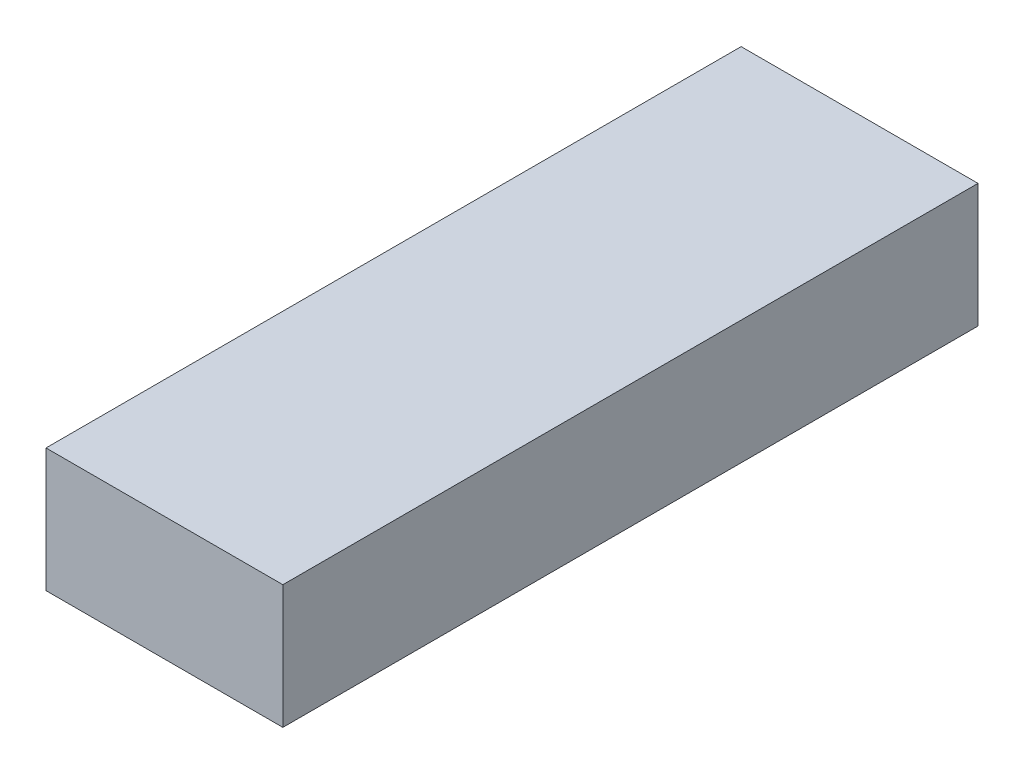
ISO-10303-21;
HEADER;
FILE_DESCRIPTION(('STEP AP214'),'2;1');
FILE_NAME('part.step','',(''),(''),'','','');
FILE_SCHEMA(('AUTOMOTIVE_DESIGN { 1 0 10303 214 1 1 1 1 }'));
ENDSEC;
DATA;
#1=APPLICATION_CONTEXT('core data for automotive mechanical design processes');
#2=APPLICATION_PROTOCOL_DEFINITION('international standard','automotive_design',2000,#1);
#3=PRODUCT_CONTEXT('',#1,'mechanical');
#4=PRODUCT('Part','Part','',(#3));
#5=PRODUCT_RELATED_PRODUCT_CATEGORY('part','',(#4));
#6=PRODUCT_DEFINITION_FORMATION('','',#4);
#7=PRODUCT_DEFINITION_CONTEXT('part definition',#1,'design');
#8=PRODUCT_DEFINITION('design','',#6,#7);
#9=PRODUCT_DEFINITION_SHAPE('','',#8);
#10=(LENGTH_UNIT() NAMED_UNIT(*) SI_UNIT(.MILLI.,.METRE.));
#11=(NAMED_UNIT(*) PLANE_ANGLE_UNIT() SI_UNIT($,.RADIAN.));
#12=(NAMED_UNIT(*) SI_UNIT($,.STERADIAN.) SOLID_ANGLE_UNIT());
#13=UNCERTAINTY_MEASURE_WITH_UNIT(LENGTH_MEASURE(1.E-05),#10,'distance_accuracy_value','');
#14=(GEOMETRIC_REPRESENTATION_CONTEXT(3) GLOBAL_UNCERTAINTY_ASSIGNED_CONTEXT((#13)) GLOBAL_UNIT_ASSIGNED_CONTEXT((#10,
#11,#12)) REPRESENTATION_CONTEXT('',''));
#15=CARTESIAN_POINT('',(0.,0.,0.));
#16=DIRECTION('',(0.,0.,1.));
#17=DIRECTION('',(1.,0.,0.));
#18=AXIS2_PLACEMENT_3D('',#15,#16,#17);
#19=CARTESIAN_POINT('',(0.,24.,0.));
#20=DIRECTION('',(0.,0.,-1.));
#21=DIRECTION('',(-1.,0.,0.));
#22=AXIS2_PLACEMENT_3D('',#19,#20,#21);
#23=PLANE('',#22);
#24=DIRECTION('',(1.,0.,0.));
#25=VECTOR('',#24,1.);
#26=CARTESIAN_POINT('',(0.,0.,0.));
#27=LINE('',#26,#25);
#28=CARTESIAN_POINT('',(0.,0.,0.));
#29=VERTEX_POINT('',#28);
#30=CARTESIAN_POINT('',(46.,0.,0.));
#31=VERTEX_POINT('',#30);
#32=EDGE_CURVE('E116',#29,#31,#27,.T.);
#33=ORIENTED_EDGE('',*,*,#32,.T.);
#34=DIRECTION('',(0.,-1.,0.));
#35=VECTOR('',#34,1.);
#36=CARTESIAN_POINT('',(46.,24.,0.));
#37=LINE('',#36,#35);
#38=CARTESIAN_POINT('',(46.,24.,0.));
#39=VERTEX_POINT('',#38);
#40=EDGE_CURVE('E11',#39,#31,#37,.T.);
#41=ORIENTED_EDGE('',*,*,#40,.F.);
#42=DIRECTION('',(1.,0.,0.));
#43=VECTOR('',#42,1.);
#44=CARTESIAN_POINT('',(0.,24.,0.));
#45=LINE('',#44,#43);
#46=CARTESIAN_POINT('',(0.,24.,0.));
#47=VERTEX_POINT('',#46);
#48=EDGE_CURVE('E98',#47,#39,#45,.T.);
#49=ORIENTED_EDGE('',*,*,#48,.F.);
#50=DIRECTION('',(0.,-1.,0.));
#51=VECTOR('',#50,1.);
#52=CARTESIAN_POINT('',(0.,24.,0.));
#53=LINE('',#52,#51);
#54=EDGE_CURVE('E65',#47,#29,#53,.T.);
#55=ORIENTED_EDGE('',*,*,#54,.T.);
#56=EDGE_LOOP('',(#33,#41,#49,#55));
#57=FACE_BOUND('',#56,.T.);
#58=ADVANCED_FACE('F48',(#57),#23,.F.);
#59=CARTESIAN_POINT('',(46.,24.,0.));
#60=DIRECTION('',(-1.,0.,0.));
#61=DIRECTION('',(0.,0.,1.));
#62=AXIS2_PLACEMENT_3D('',#59,#60,#61);
#63=PLANE('',#62);
#64=DIRECTION('',(0.,0.,-1.));
#65=VECTOR('',#64,1.);
#66=CARTESIAN_POINT('',(46.,0.,0.));
#67=LINE('',#66,#65);
#68=CARTESIAN_POINT('',(46.,0.,-135.));
#69=VERTEX_POINT('',#68);
#70=EDGE_CURVE('E104',#31,#69,#67,.T.);
#71=ORIENTED_EDGE('',*,*,#70,.T.);
#72=DIRECTION('',(0.,-1.,0.));
#73=VECTOR('',#72,1.);
#74=CARTESIAN_POINT('',(46.,24.,-135.));
#75=LINE('',#74,#73);
#76=CARTESIAN_POINT('',(46.,24.,-135.));
#77=VERTEX_POINT('',#76);
#78=EDGE_CURVE('E57',#77,#69,#75,.T.);
#79=ORIENTED_EDGE('',*,*,#78,.F.);
#80=DIRECTION('',(0.,0.,-1.));
#81=VECTOR('',#80,1.);
#82=CARTESIAN_POINT('',(46.,24.,0.));
#83=LINE('',#82,#81);
#84=EDGE_CURVE('E90',#39,#77,#83,.T.);
#85=ORIENTED_EDGE('',*,*,#84,.F.);
#86=ORIENTED_EDGE('',*,*,#40,.T.);
#87=EDGE_LOOP('',(#71,#79,#85,#86));
#88=FACE_BOUND('',#87,.T.);
#89=ADVANCED_FACE('F103',(#88),#63,.F.);
#90=CARTESIAN_POINT('',(0.,24.,-135.));
#91=DIRECTION('',(0.,0.,-1.));
#92=DIRECTION('',(-1.,0.,0.));
#93=AXIS2_PLACEMENT_3D('',#90,#91,#92);
#94=PLANE('',#93);
#95=DIRECTION('',(1.,0.,0.));
#96=VECTOR('',#95,1.);
#97=CARTESIAN_POINT('',(0.,0.,-135.));
#98=LINE('',#97,#96);
#99=CARTESIAN_POINT('',(0.,0.,-135.));
#100=VERTEX_POINT('',#99);
#101=EDGE_CURVE('E121',#100,#69,#98,.T.);
#102=ORIENTED_EDGE('',*,*,#101,.F.);
#103=DIRECTION('',(0.,-1.,0.));
#104=VECTOR('',#103,1.);
#105=CARTESIAN_POINT('',(0.,24.,-135.));
#106=LINE('',#105,#104);
#107=CARTESIAN_POINT('',(0.,24.,-135.));
#108=VERTEX_POINT('',#107);
#109=EDGE_CURVE('E79',#108,#100,#106,.T.);
#110=ORIENTED_EDGE('',*,*,#109,.F.);
#111=DIRECTION('',(1.,0.,0.));
#112=VECTOR('',#111,1.);
#113=CARTESIAN_POINT('',(0.,24.,-135.));
#114=LINE('',#113,#112);
#115=EDGE_CURVE('E97',#108,#77,#114,.T.);
#116=ORIENTED_EDGE('',*,*,#115,.T.);
#117=ORIENTED_EDGE('',*,*,#78,.T.);
#118=EDGE_LOOP('',(#102,#110,#116,#117));
#119=FACE_BOUND('',#118,.T.);
#120=ADVANCED_FACE('F108',(#119),#94,.T.);
#121=CARTESIAN_POINT('',(0.,24.,0.));
#122=DIRECTION('',(-1.,0.,0.));
#123=DIRECTION('',(0.,0.,1.));
#124=AXIS2_PLACEMENT_3D('',#121,#122,#123);
#125=PLANE('',#124);
#126=DIRECTION('',(0.,0.,-1.));
#127=VECTOR('',#126,1.);
#128=CARTESIAN_POINT('',(0.,0.,0.));
#129=LINE('',#128,#127);
#130=EDGE_CURVE('E124',#29,#100,#129,.T.);
#131=ORIENTED_EDGE('',*,*,#130,.F.);
#132=ORIENTED_EDGE('',*,*,#54,.F.);
#133=DIRECTION('',(0.,0.,-1.));
#134=VECTOR('',#133,1.);
#135=CARTESIAN_POINT('',(0.,24.,0.));
#136=LINE('',#135,#134);
#137=EDGE_CURVE('E110',#47,#108,#136,.T.);
#138=ORIENTED_EDGE('',*,*,#137,.T.);
#139=ORIENTED_EDGE('',*,*,#109,.T.);
#140=EDGE_LOOP('',(#131,#132,#138,#139));
#141=FACE_BOUND('',#140,.T.);
#142=ADVANCED_FACE('F134',(#141),#125,.T.);
#143=CARTESIAN_POINT('',(0.,24.,0.));
#144=DIRECTION('',(0.,1.,0.));
#145=DIRECTION('',(0.,0.,1.));
#146=AXIS2_PLACEMENT_3D('',#143,#144,#145);
#147=PLANE('',#146);
#148=ORIENTED_EDGE('',*,*,#48,.T.);
#149=ORIENTED_EDGE('',*,*,#84,.T.);
#150=ORIENTED_EDGE('',*,*,#115,.F.);
#151=ORIENTED_EDGE('',*,*,#137,.F.);
#152=EDGE_LOOP('',(#148,#149,#150,#151));
#153=FACE_BOUND('',#152,.T.);
#154=ADVANCED_FACE('F94',(#153),#147,.T.);
#155=CARTESIAN_POINT('',(0.,0.,0.));
#156=DIRECTION('',(0.,1.,0.));
#157=DIRECTION('',(0.,0.,1.));
#158=AXIS2_PLACEMENT_3D('',#155,#156,#157);
#159=PLANE('',#158);
#160=ORIENTED_EDGE('',*,*,#32,.F.);
#161=ORIENTED_EDGE('',*,*,#130,.T.);
#162=ORIENTED_EDGE('',*,*,#101,.T.);
#163=ORIENTED_EDGE('',*,*,#70,.F.);
#164=EDGE_LOOP('',(#160,#161,#162,#163));
#165=FACE_BOUND('',#164,.T.);
#166=ADVANCED_FACE('F133',(#165),#159,.F.);
#167=CLOSED_SHELL('',(#58,#89,#120,#142,#154,#166));
#168=MANIFOLD_SOLID_BREP('B2',#167);
#169=ADVANCED_BREP_SHAPE_REPRESENTATION('',(#18,#168),#14);
#170=SHAPE_DEFINITION_REPRESENTATION(#9,#169);
ENDSEC;
END-ISO-10303-21;
